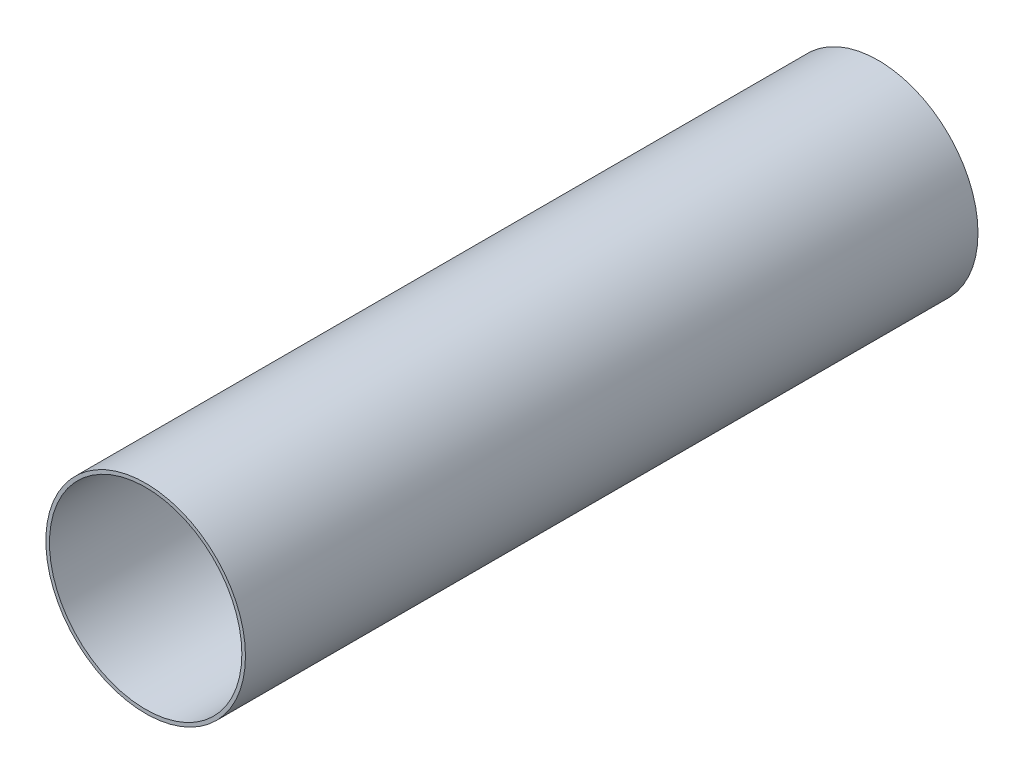
ISO-10303-21;
HEADER;
FILE_DESCRIPTION(('STEP AP214'),'2;1');
FILE_NAME('part.step','',(''),(''),'','','');
FILE_SCHEMA(('AUTOMOTIVE_DESIGN { 1 0 10303 214 1 1 1 1 }'));
ENDSEC;
DATA;
#1=APPLICATION_CONTEXT('core data for automotive mechanical design processes');
#2=APPLICATION_PROTOCOL_DEFINITION('international standard','automotive_design',2000,#1);
#3=PRODUCT_CONTEXT('',#1,'mechanical');
#4=PRODUCT('Part','Part','',(#3));
#5=PRODUCT_RELATED_PRODUCT_CATEGORY('part','',(#4));
#6=PRODUCT_DEFINITION_FORMATION('','',#4);
#7=PRODUCT_DEFINITION_CONTEXT('part definition',#1,'design');
#8=PRODUCT_DEFINITION('design','',#6,#7);
#9=PRODUCT_DEFINITION_SHAPE('','',#8);
#10=(LENGTH_UNIT() NAMED_UNIT(*) SI_UNIT(.MILLI.,.METRE.));
#11=(NAMED_UNIT(*) PLANE_ANGLE_UNIT() SI_UNIT($,.RADIAN.));
#12=(NAMED_UNIT(*) SI_UNIT($,.STERADIAN.) SOLID_ANGLE_UNIT());
#13=UNCERTAINTY_MEASURE_WITH_UNIT(LENGTH_MEASURE(1.E-05),#10,'distance_accuracy_value','');
#14=(GEOMETRIC_REPRESENTATION_CONTEXT(3) GLOBAL_UNCERTAINTY_ASSIGNED_CONTEXT((#13)) GLOBAL_UNIT_ASSIGNED_CONTEXT((#10,
#11,#12)) REPRESENTATION_CONTEXT('',''));
#15=CARTESIAN_POINT('',(0.,0.,0.));
#16=DIRECTION('',(0.,0.,1.));
#17=DIRECTION('',(1.,0.,0.));
#18=AXIS2_PLACEMENT_3D('',#15,#16,#17);
#19=CARTESIAN_POINT('',(0.,0.,152.4));
#20=DIRECTION('',(0.,0.,1.));
#21=DIRECTION('',(1.,0.,0.));
#22=AXIS2_PLACEMENT_3D('',#19,#20,#21);
#23=PLANE('',#22);
#24=CARTESIAN_POINT('',(0.,0.,152.4));
#25=DIRECTION('',(0.,0.,1.));
#26=DIRECTION('',(1.,0.,0.));
#27=AXIS2_PLACEMENT_3D('',#24,#25,#26);
#28=CIRCLE('',#27,20.7645);
#29=CARTESIAN_POINT('',(20.7645,0.,152.4));
#30=VERTEX_POINT('',#29);
#31=EDGE_CURVE('E11',#30,#30,#28,.T.);
#32=ORIENTED_EDGE('',*,*,#31,.T.);
#33=EDGE_LOOP('',(#32));
#34=FACE_BOUND('',#33,.T.);
#35=CARTESIAN_POINT('',(0.,0.,152.4));
#36=DIRECTION('',(0.,0.,1.));
#37=DIRECTION('',(1.,0.,0.));
#38=AXIS2_PLACEMENT_3D('',#35,#36,#37);
#39=CIRCLE('',#38,20.0145);
#40=CARTESIAN_POINT('',(20.0145,0.,152.4));
#41=VERTEX_POINT('',#40);
#42=EDGE_CURVE('E47',#41,#41,#39,.T.);
#43=ORIENTED_EDGE('',*,*,#42,.F.);
#44=EDGE_LOOP('',(#43));
#45=FACE_BOUND('',#44,.T.);
#46=ADVANCED_FACE('F36',(#34,#45),#23,.T.);
#47=CARTESIAN_POINT('',(0.,0.,0.));
#48=DIRECTION('',(0.,0.,1.));
#49=DIRECTION('',(1.,0.,0.));
#50=AXIS2_PLACEMENT_3D('',#47,#48,#49);
#51=PLANE('',#50);
#52=CARTESIAN_POINT('',(0.,0.,0.));
#53=DIRECTION('',(0.,0.,1.));
#54=DIRECTION('',(1.,0.,0.));
#55=AXIS2_PLACEMENT_3D('',#52,#53,#54);
#56=CIRCLE('',#55,20.7645);
#57=CARTESIAN_POINT('',(20.7645,0.,0.));
#58=VERTEX_POINT('',#57);
#59=EDGE_CURVE('E40',#58,#58,#56,.T.);
#60=ORIENTED_EDGE('',*,*,#59,.F.);
#61=EDGE_LOOP('',(#60));
#62=FACE_BOUND('',#61,.T.);
#63=CARTESIAN_POINT('',(0.,0.,0.));
#64=DIRECTION('',(0.,0.,1.));
#65=DIRECTION('',(1.,0.,0.));
#66=AXIS2_PLACEMENT_3D('',#63,#64,#65);
#67=CIRCLE('',#66,20.0145);
#68=CARTESIAN_POINT('',(20.0145,0.,0.));
#69=VERTEX_POINT('',#68);
#70=EDGE_CURVE('E49',#69,#69,#67,.T.);
#71=ORIENTED_EDGE('',*,*,#70,.T.);
#72=EDGE_LOOP('',(#71));
#73=FACE_BOUND('',#72,.T.);
#74=ADVANCED_FACE('F59',(#62,#73),#51,.F.);
#75=CARTESIAN_POINT('',(0.,0.,152.4));
#76=DIRECTION('',(0.,0.,-1.));
#77=DIRECTION('',(-1.,0.,0.));
#78=AXIS2_PLACEMENT_3D('',#75,#76,#77);
#79=CYLINDRICAL_SURFACE('',#78,20.7645);
#80=ORIENTED_EDGE('',*,*,#31,.F.);
#81=EDGE_LOOP('',(#80));
#82=FACE_BOUND('',#81,.T.);
#83=ORIENTED_EDGE('',*,*,#59,.T.);
#84=EDGE_LOOP('',(#83));
#85=FACE_BOUND('',#84,.T.);
#86=ADVANCED_FACE('F38',(#82,#85),#79,.T.);
#87=CARTESIAN_POINT('',(0.,0.,152.4));
#88=DIRECTION('',(0.,0.,-1.));
#89=DIRECTION('',(-1.,0.,0.));
#90=AXIS2_PLACEMENT_3D('',#87,#88,#89);
#91=CYLINDRICAL_SURFACE('',#90,20.0145);
#92=ORIENTED_EDGE('',*,*,#42,.T.);
#93=EDGE_LOOP('',(#92));
#94=FACE_BOUND('',#93,.T.);
#95=ORIENTED_EDGE('',*,*,#70,.F.);
#96=EDGE_LOOP('',(#95));
#97=FACE_BOUND('',#96,.T.);
#98=ADVANCED_FACE('F55',(#94,#97),#91,.F.);
#99=CLOSED_SHELL('',(#46,#74,#86,#98));
#100=MANIFOLD_SOLID_BREP('B2',#99);
#101=ADVANCED_BREP_SHAPE_REPRESENTATION('',(#18,#100),#14);
#102=SHAPE_DEFINITION_REPRESENTATION(#9,#101);
ENDSEC;
END-ISO-10303-21;
